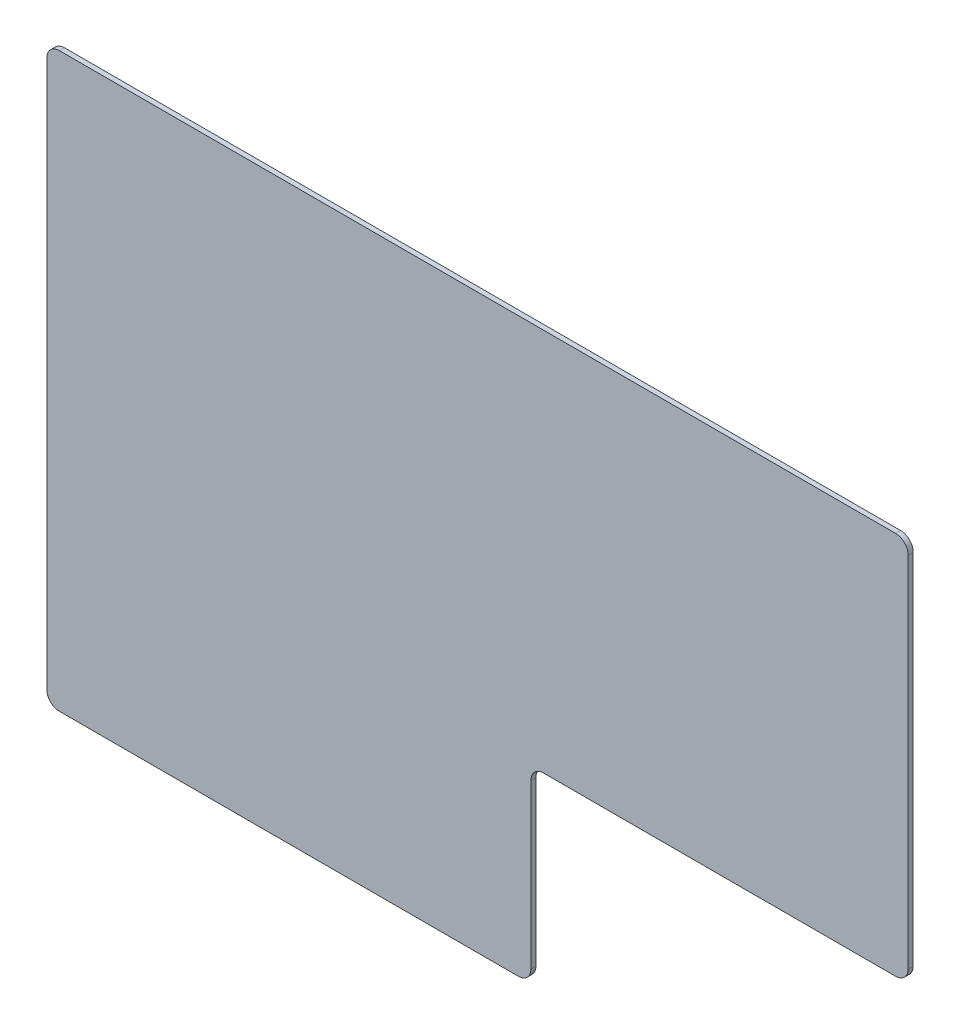
ISO-10303-21;
HEADER;
FILE_DESCRIPTION(('STEP AP214'),'2;1');
FILE_NAME('part.step','',(''),(''),'','','');
FILE_SCHEMA(('AUTOMOTIVE_DESIGN { 1 0 10303 214 1 1 1 1 }'));
ENDSEC;
DATA;
#1=APPLICATION_CONTEXT('core data for automotive mechanical design processes');
#2=APPLICATION_PROTOCOL_DEFINITION('international standard','automotive_design',2000,#1);
#3=PRODUCT_CONTEXT('',#1,'mechanical');
#4=PRODUCT('Part','Part','',(#3));
#5=PRODUCT_RELATED_PRODUCT_CATEGORY('part','',(#4));
#6=PRODUCT_DEFINITION_FORMATION('','',#4);
#7=PRODUCT_DEFINITION_CONTEXT('part definition',#1,'design');
#8=PRODUCT_DEFINITION('design','',#6,#7);
#9=PRODUCT_DEFINITION_SHAPE('','',#8);
#10=(LENGTH_UNIT() NAMED_UNIT(*) SI_UNIT(.MILLI.,.METRE.));
#11=(NAMED_UNIT(*) PLANE_ANGLE_UNIT() SI_UNIT($,.RADIAN.));
#12=(NAMED_UNIT(*) SI_UNIT($,.STERADIAN.) SOLID_ANGLE_UNIT());
#13=UNCERTAINTY_MEASURE_WITH_UNIT(LENGTH_MEASURE(1.E-05),#10,'distance_accuracy_value','');
#14=(GEOMETRIC_REPRESENTATION_CONTEXT(3) GLOBAL_UNCERTAINTY_ASSIGNED_CONTEXT((#13)) GLOBAL_UNIT_ASSIGNED_CONTEXT((#10,
#11,#12)) REPRESENTATION_CONTEXT('',''));
#15=CARTESIAN_POINT('',(0.,0.,0.));
#16=DIRECTION('',(0.,0.,1.));
#17=DIRECTION('',(1.,0.,0.));
#18=AXIS2_PLACEMENT_3D('',#15,#16,#17);
#19=CARTESIAN_POINT('',(-0.0949999999996768,0.164999999999999,0.));
#20=DIRECTION('',(0.,0.,1.));
#21=DIRECTION('',(1.,0.,0.));
#22=AXIS2_PLACEMENT_3D('',#19,#20,#21);
#23=PLANE('',#22);
#24=DIRECTION('',(0.,1.,0.));
#25=VECTOR('',#24,1.);
#26=CARTESIAN_POINT('',(-0.194999999999705,4.51500000150653,0.));
#27=LINE('',#26,#25);
#28=CARTESIAN_POINT('',(-0.194999999999676,0.164999999999999,0.));
#29=VERTEX_POINT('',#28);
#30=CARTESIAN_POINT('',(-0.194999999999705,4.51500000150653,0.));
#31=VERTEX_POINT('',#30);
#32=EDGE_CURVE('E106',#29,#31,#27,.T.);
#33=ORIENTED_EDGE('',*,*,#32,.T.);
#34=CARTESIAN_POINT('',(-0.0949999999997042,4.51500000150653,0.));
#35=DIRECTION('',(0.,0.,-1.));
#36=DIRECTION('',(-1.,0.,0.));
#37=AXIS2_PLACEMENT_3D('',#34,#35,#36);
#38=CIRCLE('',#37,0.100000000000001);
#39=CARTESIAN_POINT('',(-0.0949999999997038,4.61500000150653,0.));
#40=VERTEX_POINT('',#39);
#41=EDGE_CURVE('E129',#40,#31,#38,.F.);
#42=ORIENTED_EDGE('',*,*,#41,.F.);
#43=DIRECTION('',(1.,0.,0.));
#44=VECTOR('',#43,1.);
#45=CARTESIAN_POINT('',(6.5550000000003,4.61500000150653,0.));
#46=LINE('',#45,#44);
#47=CARTESIAN_POINT('',(6.5550000000003,4.61500000150653,0.));
#48=VERTEX_POINT('',#47);
#49=EDGE_CURVE('E126',#40,#48,#46,.T.);
#50=ORIENTED_EDGE('',*,*,#49,.T.);
#51=CARTESIAN_POINT('',(6.5550000000003,4.51500000150653,0.));
#52=DIRECTION('',(0.,0.,-1.));
#53=DIRECTION('',(-1.,0.,0.));
#54=AXIS2_PLACEMENT_3D('',#51,#52,#53);
#55=CIRCLE('',#54,0.1);
#56=CARTESIAN_POINT('',(6.6550000000003,4.51500000150653,0.));
#57=VERTEX_POINT('',#56);
#58=EDGE_CURVE('E134',#57,#48,#55,.F.);
#59=ORIENTED_EDGE('',*,*,#58,.F.);
#60=DIRECTION('',(0.,-1.,0.));
#61=VECTOR('',#60,1.);
#62=CARTESIAN_POINT('',(6.65500000000032,1.665,0.));
#63=LINE('',#62,#61);
#64=CARTESIAN_POINT('',(6.65500000000032,1.665,0.));
#65=VERTEX_POINT('',#64);
#66=EDGE_CURVE('E131',#57,#65,#63,.T.);
#67=ORIENTED_EDGE('',*,*,#66,.T.);
#68=CARTESIAN_POINT('',(6.55500000000032,1.665,0.));
#69=DIRECTION('',(0.,0.,-1.));
#70=DIRECTION('',(-1.,0.,0.));
#71=AXIS2_PLACEMENT_3D('',#68,#69,#70);
#72=CIRCLE('',#71,0.0999999999999994);
#73=CARTESIAN_POINT('',(6.55500000000032,1.565,0.));
#74=VERTEX_POINT('',#73);
#75=EDGE_CURVE('E139',#74,#65,#72,.F.);
#76=ORIENTED_EDGE('',*,*,#75,.F.);
#77=DIRECTION('',(1.,0.,0.));
#78=VECTOR('',#77,1.);
#79=CARTESIAN_POINT('',(3.75500000107356,1.565,0.));
#80=LINE('',#79,#78);
#81=CARTESIAN_POINT('',(3.75500000107356,1.565,0.));
#82=VERTEX_POINT('',#81);
#83=EDGE_CURVE('E136',#74,#82,#80,.F.);
#84=ORIENTED_EDGE('',*,*,#83,.T.);
#85=CARTESIAN_POINT('',(3.75500000107356,1.465,0.));
#86=DIRECTION('',(0.,0.,-1.));
#87=DIRECTION('',(-1.,0.,0.));
#88=AXIS2_PLACEMENT_3D('',#85,#86,#87);
#89=CIRCLE('',#88,0.0999999999999998);
#90=CARTESIAN_POINT('',(3.65500000107356,1.465,0.));
#91=VERTEX_POINT('',#90);
#92=EDGE_CURVE('E172',#82,#91,#89,.F.);
#93=ORIENTED_EDGE('',*,*,#92,.T.);
#94=DIRECTION('',(0.,-1.,0.));
#95=VECTOR('',#94,1.);
#96=CARTESIAN_POINT('',(3.65500000107357,0.164999999999999,0.));
#97=LINE('',#96,#95);
#98=CARTESIAN_POINT('',(3.65500000107357,0.164999999999998,0.));
#99=VERTEX_POINT('',#98);
#100=EDGE_CURVE('E141',#91,#99,#97,.T.);
#101=ORIENTED_EDGE('',*,*,#100,.T.);
#102=CARTESIAN_POINT('',(3.55500000107357,0.164999999999998,0.));
#103=DIRECTION('',(0.,0.,-1.));
#104=DIRECTION('',(-1.,0.,0.));
#105=AXIS2_PLACEMENT_3D('',#102,#103,#104);
#106=CIRCLE('',#105,0.099999999999999);
#107=CARTESIAN_POINT('',(3.55500000107357,0.0649999999999992,0.));
#108=VERTEX_POINT('',#107);
#109=EDGE_CURVE('E147',#108,#99,#106,.F.);
#110=ORIENTED_EDGE('',*,*,#109,.F.);
#111=DIRECTION('',(1.,0.,0.));
#112=VECTOR('',#111,1.);
#113=CARTESIAN_POINT('',(-0.094999999999678,0.0649999999999991,0.));
#114=LINE('',#113,#112);
#115=CARTESIAN_POINT('',(-0.0949999999996774,0.0649999999999991,0.));
#116=VERTEX_POINT('',#115);
#117=EDGE_CURVE('E108',#108,#116,#114,.F.);
#118=ORIENTED_EDGE('',*,*,#117,.T.);
#119=CARTESIAN_POINT('',(-0.0949999999996768,0.164999999999999,0.));
#120=DIRECTION('',(0.,0.,-1.));
#121=DIRECTION('',(-1.,0.,0.));
#122=AXIS2_PLACEMENT_3D('',#119,#120,#121);
#123=CIRCLE('',#122,0.0999999999999995);
#124=EDGE_CURVE('E20',#29,#116,#123,.F.);
#125=ORIENTED_EDGE('',*,*,#124,.F.);
#126=EDGE_LOOP('',(#33,#42,#50,#59,#67,#76,#84,#93,#101,#110,#118,#125));
#127=FACE_BOUND('',#126,.T.);
#128=ADVANCED_FACE('F17',(#127),#23,.F.);
#129=CARTESIAN_POINT('',(-0.0949999999996768,0.164999999999999,0.04));
#130=DIRECTION('',(0.,0.,-1.));
#131=DIRECTION('',(-1.,0.,0.));
#132=AXIS2_PLACEMENT_3D('',#129,#130,#131);
#133=CYLINDRICAL_SURFACE('',#132,0.0999999999999995);
#134=CARTESIAN_POINT('',(-0.0949999999996768,0.164999999999999,0.04));
#135=DIRECTION('',(0.,0.,-1.));
#136=DIRECTION('',(-1.,0.,0.));
#137=AXIS2_PLACEMENT_3D('',#134,#135,#136);
#138=CIRCLE('',#137,0.0999999999999995);
#139=CARTESIAN_POINT('',(-0.194999999999691,0.164999999999999,0.04));
#140=VERTEX_POINT('',#139);
#141=CARTESIAN_POINT('',(-0.0949999999996774,0.0649999999999991,0.04));
#142=VERTEX_POINT('',#141);
#143=EDGE_CURVE('E116',#140,#142,#138,.F.);
#144=ORIENTED_EDGE('',*,*,#143,.F.);
#145=DIRECTION('',(0.,0.,1.));
#146=VECTOR('',#145,1.);
#147=CARTESIAN_POINT('',(-0.194999999999676,0.164999999999999,0.04));
#148=LINE('',#147,#146);
#149=EDGE_CURVE('E113',#140,#29,#148,.F.);
#150=ORIENTED_EDGE('',*,*,#149,.T.);
#151=ORIENTED_EDGE('',*,*,#124,.T.);
#152=DIRECTION('',(0.,0.,1.));
#153=VECTOR('',#152,1.);
#154=CARTESIAN_POINT('',(-0.094999999999678,0.0649999999999991,0.04));
#155=LINE('',#154,#153);
#156=EDGE_CURVE('E111',#116,#142,#155,.T.);
#157=ORIENTED_EDGE('',*,*,#156,.T.);
#158=EDGE_LOOP('',(#144,#150,#151,#157));
#159=FACE_BOUND('',#158,.T.);
#160=ADVANCED_FACE('F114',(#159),#133,.T.);
#161=CARTESIAN_POINT('',(-0.094999999999678,0.0649999999999991,0.04));
#162=DIRECTION('',(0.,1.,0.));
#163=DIRECTION('',(0.,0.,1.));
#164=AXIS2_PLACEMENT_3D('',#161,#162,#163);
#165=PLANE('',#164);
#166=DIRECTION('',(0.,0.,-1.));
#167=VECTOR('',#166,1.);
#168=CARTESIAN_POINT('',(3.55500000107357,0.0649999999999993,0.04));
#169=LINE('',#168,#167);
#170=CARTESIAN_POINT('',(3.55500000107357,0.0649999999999992,0.04));
#171=VERTEX_POINT('',#170);
#172=EDGE_CURVE('E174',#171,#108,#169,.T.);
#173=ORIENTED_EDGE('',*,*,#172,.F.);
#174=DIRECTION('',(1.,0.,0.));
#175=VECTOR('',#174,1.);
#176=CARTESIAN_POINT('',(-0.0949999999996768,0.0649999999999991,0.04));
#177=LINE('',#176,#175);
#178=EDGE_CURVE('E121',#142,#171,#177,.T.);
#179=ORIENTED_EDGE('',*,*,#178,.F.);
#180=ORIENTED_EDGE('',*,*,#156,.F.);
#181=ORIENTED_EDGE('',*,*,#117,.F.);
#182=EDGE_LOOP('',(#173,#179,#180,#181));
#183=FACE_BOUND('',#182,.T.);
#184=ADVANCED_FACE('F301',(#183),#165,.F.);
#185=CARTESIAN_POINT('',(3.55500000107357,0.164999999999998,0.04));
#186=DIRECTION('',(0.,0.,-1.));
#187=DIRECTION('',(-1.,0.,0.));
#188=AXIS2_PLACEMENT_3D('',#185,#186,#187);
#189=CYLINDRICAL_SURFACE('',#188,0.099999999999999);
#190=CARTESIAN_POINT('',(3.55500000107357,0.164999999999998,0.04));
#191=DIRECTION('',(0.,0.,-1.));
#192=DIRECTION('',(-1.,0.,0.));
#193=AXIS2_PLACEMENT_3D('',#190,#191,#192);
#194=CIRCLE('',#193,0.099999999999999);
#195=CARTESIAN_POINT('',(3.65500000107357,0.164999999999998,0.04));
#196=VERTEX_POINT('',#195);
#197=EDGE_CURVE('E163',#171,#196,#194,.F.);
#198=ORIENTED_EDGE('',*,*,#197,.F.);
#199=ORIENTED_EDGE('',*,*,#172,.T.);
#200=ORIENTED_EDGE('',*,*,#109,.T.);
#201=DIRECTION('',(0.,0.,1.));
#202=VECTOR('',#201,1.);
#203=CARTESIAN_POINT('',(3.65500000107357,0.164999999999998,0.04));
#204=LINE('',#203,#202);
#205=EDGE_CURVE('E145',#99,#196,#204,.T.);
#206=ORIENTED_EDGE('',*,*,#205,.T.);
#207=EDGE_LOOP('',(#198,#199,#200,#206));
#208=FACE_BOUND('',#207,.T.);
#209=ADVANCED_FACE('F292',(#208),#189,.T.);
#210=CARTESIAN_POINT('',(3.65500000107357,0.164999999999999,0.04));
#211=DIRECTION('',(-1.,0.,0.));
#212=DIRECTION('',(0.,-1.,0.));
#213=AXIS2_PLACEMENT_3D('',#210,#211,#212);
#214=PLANE('',#213);
#215=DIRECTION('',(0.,0.,-1.));
#216=VECTOR('',#215,1.);
#217=CARTESIAN_POINT('',(3.65500000107356,1.465,0.04));
#218=LINE('',#217,#216);
#219=CARTESIAN_POINT('',(3.65500000107357,1.465,0.04));
#220=VERTEX_POINT('',#219);
#221=EDGE_CURVE('E144',#91,#220,#218,.F.);
#222=ORIENTED_EDGE('',*,*,#221,.T.);
#223=DIRECTION('',(0.,1.,0.));
#224=VECTOR('',#223,1.);
#225=CARTESIAN_POINT('',(3.65500000107357,0.164999999999999,0.04));
#226=LINE('',#225,#224);
#227=EDGE_CURVE('E162',#196,#220,#226,.T.);
#228=ORIENTED_EDGE('',*,*,#227,.F.);
#229=ORIENTED_EDGE('',*,*,#205,.F.);
#230=ORIENTED_EDGE('',*,*,#100,.F.);
#231=EDGE_LOOP('',(#222,#228,#229,#230));
#232=FACE_BOUND('',#231,.T.);
#233=ADVANCED_FACE('F283',(#232),#214,.F.);
#234=CARTESIAN_POINT('',(3.75500000107356,1.465,0.04));
#235=DIRECTION('',(0.,0.,-1.));
#236=DIRECTION('',(-1.,0.,0.));
#237=AXIS2_PLACEMENT_3D('',#234,#235,#236);
#238=CYLINDRICAL_SURFACE('',#237,0.0999999999999998);
#239=DIRECTION('',(0.,0.,1.));
#240=VECTOR('',#239,1.);
#241=CARTESIAN_POINT('',(3.75500000107356,1.565,0.04));
#242=LINE('',#241,#240);
#243=CARTESIAN_POINT('',(3.75500000107356,1.565,0.04));
#244=VERTEX_POINT('',#243);
#245=EDGE_CURVE('E140',#82,#244,#242,.T.);
#246=ORIENTED_EDGE('',*,*,#245,.T.);
#247=CARTESIAN_POINT('',(3.75500000107356,1.465,0.04));
#248=DIRECTION('',(0.,0.,-1.));
#249=DIRECTION('',(-1.,0.,0.));
#250=AXIS2_PLACEMENT_3D('',#247,#248,#249);
#251=CIRCLE('',#250,0.0999999999999998);
#252=EDGE_CURVE('E159',#220,#244,#251,.T.);
#253=ORIENTED_EDGE('',*,*,#252,.F.);
#254=ORIENTED_EDGE('',*,*,#221,.F.);
#255=ORIENTED_EDGE('',*,*,#92,.F.);
#256=EDGE_LOOP('',(#246,#253,#254,#255));
#257=FACE_BOUND('',#256,.T.);
#258=ADVANCED_FACE('F274',(#257),#238,.F.);
#259=CARTESIAN_POINT('',(3.75500000107356,1.565,0.04));
#260=DIRECTION('',(0.,1.,0.));
#261=DIRECTION('',(0.,0.,1.));
#262=AXIS2_PLACEMENT_3D('',#259,#260,#261);
#263=PLANE('',#262);
#264=DIRECTION('',(0.,0.,-1.));
#265=VECTOR('',#264,1.);
#266=CARTESIAN_POINT('',(6.55500000000032,1.565,0.04));
#267=LINE('',#266,#265);
#268=CARTESIAN_POINT('',(6.55500000000032,1.565,0.04));
#269=VERTEX_POINT('',#268);
#270=EDGE_CURVE('E171',#269,#74,#267,.T.);
#271=ORIENTED_EDGE('',*,*,#270,.F.);
#272=DIRECTION('',(1.,0.,0.));
#273=VECTOR('',#272,1.);
#274=CARTESIAN_POINT('',(-0.0949999999996768,1.565,0.04));
#275=LINE('',#274,#273);
#276=EDGE_CURVE('E158',#244,#269,#275,.T.);
#277=ORIENTED_EDGE('',*,*,#276,.F.);
#278=ORIENTED_EDGE('',*,*,#245,.F.);
#279=ORIENTED_EDGE('',*,*,#83,.F.);
#280=EDGE_LOOP('',(#271,#277,#278,#279));
#281=FACE_BOUND('',#280,.T.);
#282=ADVANCED_FACE('F265',(#281),#263,.F.);
#283=CARTESIAN_POINT('',(6.55500000000032,1.665,0.04));
#284=DIRECTION('',(0.,0.,-1.));
#285=DIRECTION('',(-1.,0.,0.));
#286=AXIS2_PLACEMENT_3D('',#283,#284,#285);
#287=CYLINDRICAL_SURFACE('',#286,0.0999999999999994);
#288=CARTESIAN_POINT('',(6.55500000000032,1.665,0.04));
#289=DIRECTION('',(0.,0.,-1.));
#290=DIRECTION('',(-1.,0.,0.));
#291=AXIS2_PLACEMENT_3D('',#288,#289,#290);
#292=CIRCLE('',#291,0.0999999999999994);
#293=CARTESIAN_POINT('',(6.65500000000032,1.665,0.04));
#294=VERTEX_POINT('',#293);
#295=EDGE_CURVE('E155',#269,#294,#292,.F.);
#296=ORIENTED_EDGE('',*,*,#295,.F.);
#297=ORIENTED_EDGE('',*,*,#270,.T.);
#298=ORIENTED_EDGE('',*,*,#75,.T.);
#299=DIRECTION('',(0.,0.,1.));
#300=VECTOR('',#299,1.);
#301=CARTESIAN_POINT('',(6.65500000000032,1.665,0.04));
#302=LINE('',#301,#300);
#303=EDGE_CURVE('E135',#65,#294,#302,.T.);
#304=ORIENTED_EDGE('',*,*,#303,.T.);
#305=EDGE_LOOP('',(#296,#297,#298,#304));
#306=FACE_BOUND('',#305,.T.);
#307=ADVANCED_FACE('F256',(#306),#287,.T.);
#308=CARTESIAN_POINT('',(6.65500000000032,1.665,0.04));
#309=DIRECTION('',(-1.,0.,0.));
#310=DIRECTION('',(0.,-1.,0.));
#311=AXIS2_PLACEMENT_3D('',#308,#309,#310);
#312=PLANE('',#311);
#313=DIRECTION('',(0.,0.,-1.));
#314=VECTOR('',#313,1.);
#315=CARTESIAN_POINT('',(6.6550000000003,4.51500000150653,0.04));
#316=LINE('',#315,#314);
#317=CARTESIAN_POINT('',(6.65500000000031,4.51500000150653,0.04));
#318=VERTEX_POINT('',#317);
#319=EDGE_CURVE('E169',#318,#57,#316,.T.);
#320=ORIENTED_EDGE('',*,*,#319,.F.);
#321=DIRECTION('',(0.,1.,0.));
#322=VECTOR('',#321,1.);
#323=CARTESIAN_POINT('',(6.65500000000032,0.164999999999999,0.04));
#324=LINE('',#323,#322);
#325=EDGE_CURVE('E154',#294,#318,#324,.T.);
#326=ORIENTED_EDGE('',*,*,#325,.F.);
#327=ORIENTED_EDGE('',*,*,#303,.F.);
#328=ORIENTED_EDGE('',*,*,#66,.F.);
#329=EDGE_LOOP('',(#320,#326,#327,#328));
#330=FACE_BOUND('',#329,.T.);
#331=ADVANCED_FACE('F247',(#330),#312,.F.);
#332=CARTESIAN_POINT('',(6.5550000000003,4.51500000150653,0.04));
#333=DIRECTION('',(0.,0.,-1.));
#334=DIRECTION('',(-1.,0.,0.));
#335=AXIS2_PLACEMENT_3D('',#332,#333,#334);
#336=CYLINDRICAL_SURFACE('',#335,0.1);
#337=CARTESIAN_POINT('',(6.5550000000003,4.51500000150653,0.04));
#338=DIRECTION('',(0.,0.,-1.));
#339=DIRECTION('',(-1.,0.,0.));
#340=AXIS2_PLACEMENT_3D('',#337,#338,#339);
#341=CIRCLE('',#340,0.1);
#342=CARTESIAN_POINT('',(6.5550000000003,4.61500000150653,0.04));
#343=VERTEX_POINT('',#342);
#344=EDGE_CURVE('E151',#318,#343,#341,.F.);
#345=ORIENTED_EDGE('',*,*,#344,.F.);
#346=ORIENTED_EDGE('',*,*,#319,.T.);
#347=ORIENTED_EDGE('',*,*,#58,.T.);
#348=DIRECTION('',(0.,0.,1.));
#349=VECTOR('',#348,1.);
#350=CARTESIAN_POINT('',(6.5550000000003,4.61500000150653,0.04));
#351=LINE('',#350,#349);
#352=EDGE_CURVE('E130',#48,#343,#351,.T.);
#353=ORIENTED_EDGE('',*,*,#352,.T.);
#354=EDGE_LOOP('',(#345,#346,#347,#353));
#355=FACE_BOUND('',#354,.T.);
#356=ADVANCED_FACE('F216',(#355),#336,.T.);
#357=CARTESIAN_POINT('',(6.5550000000003,4.61500000150653,0.04));
#358=DIRECTION('',(0.,-1.,0.));
#359=DIRECTION('',(1.,0.,0.));
#360=AXIS2_PLACEMENT_3D('',#357,#358,#359);
#361=PLANE('',#360);
#362=DIRECTION('',(0.,0.,-1.));
#363=VECTOR('',#362,1.);
#364=CARTESIAN_POINT('',(-0.0949999999997035,4.61500000150653,0.04));
#365=LINE('',#364,#363);
#366=CARTESIAN_POINT('',(-0.0949999999997038,4.61500000150653,0.04));
#367=VERTEX_POINT('',#366);
#368=EDGE_CURVE('E167',#367,#40,#365,.T.);
#369=ORIENTED_EDGE('',*,*,#368,.F.);
#370=DIRECTION('',(1.,0.,0.));
#371=VECTOR('',#370,1.);
#372=CARTESIAN_POINT('',(-0.0949999999996768,4.61500000150653,0.04));
#373=LINE('',#372,#371);
#374=EDGE_CURVE('E150',#343,#367,#373,.F.);
#375=ORIENTED_EDGE('',*,*,#374,.F.);
#376=ORIENTED_EDGE('',*,*,#352,.F.);
#377=ORIENTED_EDGE('',*,*,#49,.F.);
#378=EDGE_LOOP('',(#369,#375,#376,#377));
#379=FACE_BOUND('',#378,.T.);
#380=ADVANCED_FACE('F206',(#379),#361,.F.);
#381=CARTESIAN_POINT('',(-0.0949999999997042,4.51500000150653,0.04));
#382=DIRECTION('',(0.,0.,-1.));
#383=DIRECTION('',(-1.,0.,0.));
#384=AXIS2_PLACEMENT_3D('',#381,#382,#383);
#385=CYLINDRICAL_SURFACE('',#384,0.100000000000001);
#386=CARTESIAN_POINT('',(-0.0949999999997042,4.51500000150653,0.04));
#387=DIRECTION('',(0.,0.,-1.));
#388=DIRECTION('',(-1.,0.,0.));
#389=AXIS2_PLACEMENT_3D('',#386,#387,#388);
#390=CIRCLE('',#389,0.100000000000001);
#391=CARTESIAN_POINT('',(-0.194999999999705,4.51500000150653,0.04));
#392=VERTEX_POINT('',#391);
#393=EDGE_CURVE('E26',#367,#392,#390,.F.);
#394=ORIENTED_EDGE('',*,*,#393,.F.);
#395=ORIENTED_EDGE('',*,*,#368,.T.);
#396=ORIENTED_EDGE('',*,*,#41,.T.);
#397=DIRECTION('',(0.,0.,1.));
#398=VECTOR('',#397,1.);
#399=CARTESIAN_POINT('',(-0.194999999999705,4.51500000150653,0.04));
#400=LINE('',#399,#398);
#401=EDGE_CURVE('E35',#31,#392,#400,.T.);
#402=ORIENTED_EDGE('',*,*,#401,.T.);
#403=EDGE_LOOP('',(#394,#395,#396,#402));
#404=FACE_BOUND('',#403,.T.);
#405=ADVANCED_FACE('F208',(#404),#385,.T.);
#406=CARTESIAN_POINT('',(-0.194999999999705,4.51500000150653,0.04));
#407=DIRECTION('',(1.,0.,0.));
#408=DIRECTION('',(0.,1.,0.));
#409=AXIS2_PLACEMENT_3D('',#406,#407,#408);
#410=PLANE('',#409);
#411=ORIENTED_EDGE('',*,*,#149,.F.);
#412=DIRECTION('',(0.,1.,0.));
#413=VECTOR('',#412,1.);
#414=CARTESIAN_POINT('',(-0.194999999999705,0.164999999999999,0.04));
#415=LINE('',#414,#413);
#416=EDGE_CURVE('E11',#392,#140,#415,.F.);
#417=ORIENTED_EDGE('',*,*,#416,.F.);
#418=ORIENTED_EDGE('',*,*,#401,.F.);
#419=ORIENTED_EDGE('',*,*,#32,.F.);
#420=EDGE_LOOP('',(#411,#417,#418,#419));
#421=FACE_BOUND('',#420,.T.);
#422=ADVANCED_FACE('F119',(#421),#410,.F.);
#423=CARTESIAN_POINT('',(-0.0949999999996768,0.164999999999999,0.04));
#424=DIRECTION('',(0.,0.,1.));
#425=DIRECTION('',(1.,0.,0.));
#426=AXIS2_PLACEMENT_3D('',#423,#424,#425);
#427=PLANE('',#426);
#428=ORIENTED_EDGE('',*,*,#393,.T.);
#429=ORIENTED_EDGE('',*,*,#416,.T.);
#430=ORIENTED_EDGE('',*,*,#143,.T.);
#431=ORIENTED_EDGE('',*,*,#178,.T.);
#432=ORIENTED_EDGE('',*,*,#197,.T.);
#433=ORIENTED_EDGE('',*,*,#227,.T.);
#434=ORIENTED_EDGE('',*,*,#252,.T.);
#435=ORIENTED_EDGE('',*,*,#276,.T.);
#436=ORIENTED_EDGE('',*,*,#295,.T.);
#437=ORIENTED_EDGE('',*,*,#325,.T.);
#438=ORIENTED_EDGE('',*,*,#344,.T.);
#439=ORIENTED_EDGE('',*,*,#374,.T.);
#440=EDGE_LOOP('',(#428,#429,#430,#431,#432,#433,#434,#435,#436,#437,#438,#439));
#441=FACE_BOUND('',#440,.T.);
#442=ADVANCED_FACE('F202',(#441),#427,.T.);
#443=CLOSED_SHELL('',(#128,#160,#184,#209,#233,#258,#282,#307,#331,#356,#380,#405,#422,#442));
#444=MANIFOLD_SOLID_BREP('B1',#443);
#445=ADVANCED_BREP_SHAPE_REPRESENTATION('',(#18,#444),#14);
#446=SHAPE_DEFINITION_REPRESENTATION(#9,#445);
ENDSEC;
END-ISO-10303-21;
